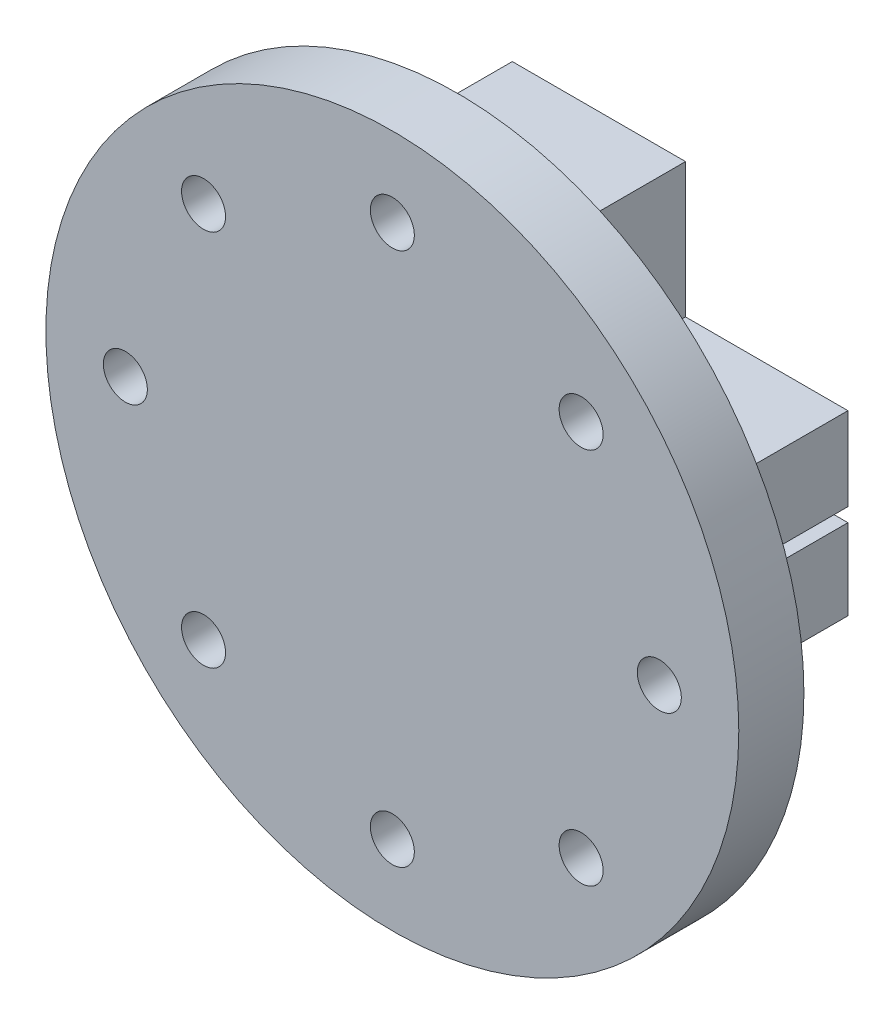
ISO-10303-21;
HEADER;
FILE_DESCRIPTION(('STEP AP214'),'2;1');
FILE_NAME('part.step','',(''),(''),'','','');
FILE_SCHEMA(('AUTOMOTIVE_DESIGN { 1 0 10303 214 1 1 1 1 }'));
ENDSEC;
DATA;
#1=APPLICATION_CONTEXT('core data for automotive mechanical design processes');
#2=APPLICATION_PROTOCOL_DEFINITION('international standard','automotive_design',2000,#1);
#3=PRODUCT_CONTEXT('',#1,'mechanical');
#4=PRODUCT('Part','Part','',(#3));
#5=PRODUCT_RELATED_PRODUCT_CATEGORY('part','',(#4));
#6=PRODUCT_DEFINITION_FORMATION('','',#4);
#7=PRODUCT_DEFINITION_CONTEXT('part definition',#1,'design');
#8=PRODUCT_DEFINITION('design','',#6,#7);
#9=PRODUCT_DEFINITION_SHAPE('','',#8);
#10=(LENGTH_UNIT() NAMED_UNIT(*) SI_UNIT(.MILLI.,.METRE.));
#11=(NAMED_UNIT(*) PLANE_ANGLE_UNIT() SI_UNIT($,.RADIAN.));
#12=(NAMED_UNIT(*) SI_UNIT($,.STERADIAN.) SOLID_ANGLE_UNIT());
#13=UNCERTAINTY_MEASURE_WITH_UNIT(LENGTH_MEASURE(1.E-05),#10,'distance_accuracy_value','');
#14=(GEOMETRIC_REPRESENTATION_CONTEXT(3) GLOBAL_UNCERTAINTY_ASSIGNED_CONTEXT((#13)) GLOBAL_UNIT_ASSIGNED_CONTEXT((#10,
#11,#12)) REPRESENTATION_CONTEXT('',''));
#15=CARTESIAN_POINT('',(0.,0.,0.));
#16=DIRECTION('',(0.,0.,1.));
#17=DIRECTION('',(1.,0.,0.));
#18=AXIS2_PLACEMENT_3D('',#15,#16,#17);
#19=CARTESIAN_POINT('',(0.,0.,0.));
#20=DIRECTION('',(0.,0.,1.));
#21=DIRECTION('',(1.,0.,0.));
#22=AXIS2_PLACEMENT_3D('',#19,#20,#21);
#23=PLANE('',#22);
#24=DIRECTION('',(1.,0.,0.));
#25=VECTOR('',#24,1.);
#26=CARTESIAN_POINT('',(0.,1.,0.));
#27=LINE('',#26,#25);
#28=CARTESIAN_POINT('',(7.7,1.,0.));
#29=VERTEX_POINT('',#28);
#30=CARTESIAN_POINT('',(30.8501032783887,1.,0.));
#31=VERTEX_POINT('',#30);
#32=EDGE_CURVE('E323',#29,#31,#27,.T.);
#33=ORIENTED_EDGE('',*,*,#32,.F.);
#34=DIRECTION('',(0.,-1.,0.));
#35=VECTOR('',#34,1.);
#36=CARTESIAN_POINT('',(7.7,0.,0.));
#37=LINE('',#36,#35);
#38=CARTESIAN_POINT('',(7.7,2.,0.));
#39=VERTEX_POINT('',#38);
#40=EDGE_CURVE('E181',#39,#29,#37,.T.);
#41=ORIENTED_EDGE('',*,*,#40,.F.);
#42=DIRECTION('',(1.,0.,0.));
#43=VECTOR('',#42,1.);
#44=CARTESIAN_POINT('',(0.,2.,0.));
#45=LINE('',#44,#43);
#46=CARTESIAN_POINT('',(5.65685424949238,2.,0.));
#47=VERTEX_POINT('',#46);
#48=EDGE_CURVE('E165',#47,#39,#45,.T.);
#49=ORIENTED_EDGE('',*,*,#48,.F.);
#50=CARTESIAN_POINT('',(0.,0.,0.));
#51=DIRECTION('',(0.,0.,1.));
#52=DIRECTION('',(1.,0.,0.));
#53=AXIS2_PLACEMENT_3D('',#50,#51,#52);
#54=CIRCLE('',#53,6.);
#55=CARTESIAN_POINT('',(5.65685424949238,-2.,0.));
#56=VERTEX_POINT('',#55);
#57=EDGE_CURVE('E348',#47,#56,#54,.T.);
#58=ORIENTED_EDGE('',*,*,#57,.T.);
#59=DIRECTION('',(1.,0.,0.));
#60=VECTOR('',#59,1.);
#61=CARTESIAN_POINT('',(0.,-1.99999999999999,0.));
#62=LINE('',#61,#60);
#63=CARTESIAN_POINT('',(7.7,-2.,0.));
#64=VERTEX_POINT('',#63);
#65=EDGE_CURVE('E341',#56,#64,#62,.T.);
#66=ORIENTED_EDGE('',*,*,#65,.T.);
#67=DIRECTION('',(0.,1.,0.));
#68=VECTOR('',#67,1.);
#69=CARTESIAN_POINT('',(7.7,0.,0.));
#70=LINE('',#69,#68);
#71=CARTESIAN_POINT('',(7.7,-1.,0.));
#72=VERTEX_POINT('',#71);
#73=EDGE_CURVE('E193',#64,#72,#70,.T.);
#74=ORIENTED_EDGE('',*,*,#73,.T.);
#75=DIRECTION('',(1.,0.,0.));
#76=VECTOR('',#75,1.);
#77=CARTESIAN_POINT('',(0.,-1.,0.));
#78=LINE('',#77,#76);
#79=CARTESIAN_POINT('',(30.8501032783887,-1.,0.));
#80=VERTEX_POINT('',#79);
#81=EDGE_CURVE('E331',#72,#80,#78,.T.);
#82=ORIENTED_EDGE('',*,*,#81,.T.);
#83=DIRECTION('',(0.,1.,0.));
#84=VECTOR('',#83,1.);
#85=CARTESIAN_POINT('',(30.8501032783887,0.,0.));
#86=LINE('',#85,#84);
#87=CARTESIAN_POINT('',(30.8501032783887,-12.6414920062023,0.));
#88=VERTEX_POINT('',#87);
#89=EDGE_CURVE('E246',#88,#80,#86,.T.);
#90=ORIENTED_EDGE('',*,*,#89,.F.);
#91=DIRECTION('',(1.,0.,0.));
#92=VECTOR('',#91,1.);
#93=CARTESIAN_POINT('',(30.8501032783887,-12.6414920062023,0.));
#94=LINE('',#93,#92);
#95=CARTESIAN_POINT('',(7.41421356237296,-12.6414920062023,0.));
#96=VERTEX_POINT('',#95);
#97=EDGE_CURVE('E205',#96,#88,#94,.T.);
#98=ORIENTED_EDGE('',*,*,#97,.F.);
#99=DIRECTION('',(0.,-1.,0.));
#100=VECTOR('',#99,1.);
#101=CARTESIAN_POINT('',(7.41421356237295,0.,0.));
#102=LINE('',#101,#100);
#103=CARTESIAN_POINT('',(7.41421356237295,-32.414213562373,0.));
#104=VERTEX_POINT('',#103);
#105=EDGE_CURVE('E250',#96,#104,#102,.T.);
#106=ORIENTED_EDGE('',*,*,#105,.T.);
#107=DIRECTION('',(-1.,0.,0.));
#108=VECTOR('',#107,1.);
#109=CARTESIAN_POINT('',(0.,-32.414213562373,0.));
#110=LINE('',#109,#108);
#111=CARTESIAN_POINT('',(-17.5857864376271,-32.414213562373,0.));
#112=VERTEX_POINT('',#111);
#113=EDGE_CURVE('E254',#104,#112,#110,.T.);
#114=ORIENTED_EDGE('',*,*,#113,.T.);
#115=DIRECTION('',(0.,1.,0.));
#116=VECTOR('',#115,1.);
#117=CARTESIAN_POINT('',(-17.585786437627,0.,0.));
#118=LINE('',#117,#116);
#119=CARTESIAN_POINT('',(-17.585786437627,32.414213562373,0.));
#120=VERTEX_POINT('',#119);
#121=EDGE_CURVE('E258',#112,#120,#118,.T.);
#122=ORIENTED_EDGE('',*,*,#121,.T.);
#123=DIRECTION('',(-1.,0.,0.));
#124=VECTOR('',#123,1.);
#125=CARTESIAN_POINT('',(0.,32.414213562373,0.));
#126=LINE('',#125,#124);
#127=CARTESIAN_POINT('',(7.41421356237296,32.414213562373,0.));
#128=VERTEX_POINT('',#127);
#129=EDGE_CURVE('E262',#128,#120,#126,.T.);
#130=ORIENTED_EDGE('',*,*,#129,.F.);
#131=DIRECTION('',(0.,1.,0.));
#132=VECTOR('',#131,1.);
#133=CARTESIAN_POINT('',(7.41421356237296,0.,0.));
#134=LINE('',#133,#132);
#135=CARTESIAN_POINT('',(7.41421356237295,13.,0.));
#136=VERTEX_POINT('',#135);
#137=EDGE_CURVE('E266',#136,#128,#134,.T.);
#138=ORIENTED_EDGE('',*,*,#137,.F.);
#139=DIRECTION('',(-1.,0.,0.));
#140=VECTOR('',#139,1.);
#141=CARTESIAN_POINT('',(30.8501032783887,13.,0.));
#142=LINE('',#141,#140);
#143=CARTESIAN_POINT('',(30.8501032783887,13.,0.));
#144=VERTEX_POINT('',#143);
#145=EDGE_CURVE('E174',#144,#136,#142,.T.);
#146=ORIENTED_EDGE('',*,*,#145,.F.);
#147=DIRECTION('',(0.,-1.,0.));
#148=VECTOR('',#147,1.);
#149=CARTESIAN_POINT('',(30.8501032783887,0.,0.));
#150=LINE('',#149,#148);
#151=EDGE_CURVE('E270',#144,#31,#150,.T.);
#152=ORIENTED_EDGE('',*,*,#151,.T.);
#153=EDGE_LOOP('',(#33,#41,#49,#58,#66,#74,#82,#90,#98,#106,#114,#122,#130,#138,#146,#152));
#154=FACE_BOUND('',#153,.T.);
#155=ADVANCED_FACE('F42',(#154),#23,.F.);
#156=CARTESIAN_POINT('',(0.,-1.,285.));
#157=DIRECTION('',(0.,1.,0.));
#158=DIRECTION('',(0.,0.,1.));
#159=AXIS2_PLACEMENT_3D('',#156,#157,#158);
#160=PLANE('',#159);
#161=CARTESIAN_POINT('',(19.1321584203808,-1.,12.75));
#162=DIRECTION('',(0.,1.,0.));
#163=DIRECTION('',(0.,0.,1.));
#164=AXIS2_PLACEMENT_3D('',#161,#162,#163);
#165=CIRCLE('',#164,3.175);
#166=CARTESIAN_POINT('',(19.1321584203808,-1.,15.925));
#167=VERTEX_POINT('',#166);
#168=EDGE_CURVE('E230',#167,#167,#165,.T.);
#169=ORIENTED_EDGE('',*,*,#168,.F.);
#170=EDGE_LOOP('',(#169));
#171=FACE_BOUND('',#170,.T.);
#172=ORIENTED_EDGE('',*,*,#81,.F.);
#173=DIRECTION('',(0.,0.,-1.));
#174=VECTOR('',#173,1.);
#175=CARTESIAN_POINT('',(7.7,-1.,25.5));
#176=LINE('',#175,#174);
#177=CARTESIAN_POINT('',(7.7,-1.,25.5));
#178=VERTEX_POINT('',#177);
#179=EDGE_CURVE('E192',#178,#72,#176,.T.);
#180=ORIENTED_EDGE('',*,*,#179,.F.);
#181=DIRECTION('',(-1.,0.,0.));
#182=VECTOR('',#181,1.);
#183=CARTESIAN_POINT('',(0.,-1.,25.5));
#184=LINE('',#183,#182);
#185=CARTESIAN_POINT('',(30.8501032783887,-1.,25.5));
#186=VERTEX_POINT('',#185);
#187=EDGE_CURVE('E334',#186,#178,#184,.T.);
#188=ORIENTED_EDGE('',*,*,#187,.F.);
#189=DIRECTION('',(0.,0.,-1.));
#190=VECTOR('',#189,1.);
#191=CARTESIAN_POINT('',(30.8501032783887,-1.,26.));
#192=LINE('',#191,#190);
#193=EDGE_CURVE('E238',#186,#80,#192,.T.);
#194=ORIENTED_EDGE('',*,*,#193,.T.);
#195=EDGE_LOOP('',(#172,#180,#188,#194));
#196=FACE_BOUND('',#195,.T.);
#197=ADVANCED_FACE('F436',(#171,#196),#160,.T.);
#198=CARTESIAN_POINT('',(0.,0.,25.5));
#199=DIRECTION('',(0.,0.,1.));
#200=DIRECTION('',(1.,0.,0.));
#201=AXIS2_PLACEMENT_3D('',#198,#199,#200);
#202=PLANE('',#201);
#203=DIRECTION('',(-1.,0.,0.));
#204=VECTOR('',#203,1.);
#205=CARTESIAN_POINT('',(0.,2.,25.5));
#206=LINE('',#205,#204);
#207=CARTESIAN_POINT('',(7.7,2.,25.5));
#208=VERTEX_POINT('',#207);
#209=CARTESIAN_POINT('',(5.65685424949238,2.,25.5));
#210=VERTEX_POINT('',#209);
#211=EDGE_CURVE('E155',#208,#210,#206,.T.);
#212=ORIENTED_EDGE('',*,*,#211,.F.);
#213=DIRECTION('',(0.,-1.,0.));
#214=VECTOR('',#213,1.);
#215=CARTESIAN_POINT('',(7.7,0.,25.5));
#216=LINE('',#215,#214);
#217=CARTESIAN_POINT('',(7.7,1.,25.5));
#218=VERTEX_POINT('',#217);
#219=EDGE_CURVE('E59',#208,#218,#216,.T.);
#220=ORIENTED_EDGE('',*,*,#219,.T.);
#221=DIRECTION('',(-1.,0.,0.));
#222=VECTOR('',#221,1.);
#223=CARTESIAN_POINT('',(0.,1.,25.5));
#224=LINE('',#223,#222);
#225=CARTESIAN_POINT('',(30.8501032783887,1.,25.5));
#226=VERTEX_POINT('',#225);
#227=EDGE_CURVE('E338',#226,#218,#224,.T.);
#228=ORIENTED_EDGE('',*,*,#227,.F.);
#229=DIRECTION('',(0.,1.,0.));
#230=VECTOR('',#229,1.);
#231=CARTESIAN_POINT('',(30.8501032783887,0.,25.5));
#232=LINE('',#231,#230);
#233=CARTESIAN_POINT('',(30.8501032783887,13.,25.5));
#234=VERTEX_POINT('',#233);
#235=EDGE_CURVE('E11',#226,#234,#232,.T.);
#236=ORIENTED_EDGE('',*,*,#235,.T.);
#237=DIRECTION('',(-1.,0.,0.));
#238=VECTOR('',#237,1.);
#239=CARTESIAN_POINT('',(30.8501032783887,13.,25.5));
#240=LINE('',#239,#238);
#241=CARTESIAN_POINT('',(7.41421356237295,13.,25.5));
#242=VERTEX_POINT('',#241);
#243=EDGE_CURVE('E217',#234,#242,#240,.T.);
#244=ORIENTED_EDGE('',*,*,#243,.T.);
#245=DIRECTION('',(0.,-1.,0.));
#246=VECTOR('',#245,1.);
#247=CARTESIAN_POINT('',(7.41421356237296,0.,25.5));
#248=LINE('',#247,#246);
#249=CARTESIAN_POINT('',(7.41421356237296,32.414213562373,25.5));
#250=VERTEX_POINT('',#249);
#251=EDGE_CURVE('E51',#250,#242,#248,.T.);
#252=ORIENTED_EDGE('',*,*,#251,.F.);
#253=DIRECTION('',(1.,0.,0.));
#254=VECTOR('',#253,1.);
#255=CARTESIAN_POINT('',(0.,32.414213562373,25.5));
#256=LINE('',#255,#254);
#257=CARTESIAN_POINT('',(-17.585786437627,32.414213562373,25.5));
#258=VERTEX_POINT('',#257);
#259=EDGE_CURVE('E404',#258,#250,#256,.T.);
#260=ORIENTED_EDGE('',*,*,#259,.F.);
#261=DIRECTION('',(0.,-1.,0.));
#262=VECTOR('',#261,1.);
#263=CARTESIAN_POINT('',(-17.585786437627,0.,25.5));
#264=LINE('',#263,#262);
#265=CARTESIAN_POINT('',(-17.5857864376271,-32.414213562373,25.5));
#266=VERTEX_POINT('',#265);
#267=EDGE_CURVE('E401',#258,#266,#264,.T.);
#268=ORIENTED_EDGE('',*,*,#267,.T.);
#269=DIRECTION('',(1.,0.,0.));
#270=VECTOR('',#269,1.);
#271=CARTESIAN_POINT('',(0.,-32.414213562373,25.5));
#272=LINE('',#271,#270);
#273=CARTESIAN_POINT('',(7.41421356237295,-32.414213562373,25.5));
#274=VERTEX_POINT('',#273);
#275=EDGE_CURVE('E398',#266,#274,#272,.T.);
#276=ORIENTED_EDGE('',*,*,#275,.T.);
#277=DIRECTION('',(0.,1.,0.));
#278=VECTOR('',#277,1.);
#279=CARTESIAN_POINT('',(7.41421356237295,0.,25.5));
#280=LINE('',#279,#278);
#281=CARTESIAN_POINT('',(7.41421356237296,-12.6414920062023,25.5));
#282=VERTEX_POINT('',#281);
#283=EDGE_CURVE('E395',#274,#282,#280,.T.);
#284=ORIENTED_EDGE('',*,*,#283,.T.);
#285=DIRECTION('',(1.,0.,0.));
#286=VECTOR('',#285,1.);
#287=CARTESIAN_POINT('',(30.8501032783887,-12.6414920062023,25.5));
#288=LINE('',#287,#286);
#289=CARTESIAN_POINT('',(30.8501032783887,-12.6414920062023,25.5));
#290=VERTEX_POINT('',#289);
#291=EDGE_CURVE('E66',#282,#290,#288,.T.);
#292=ORIENTED_EDGE('',*,*,#291,.T.);
#293=DIRECTION('',(0.,-1.,0.));
#294=VECTOR('',#293,1.);
#295=CARTESIAN_POINT('',(30.8501032783887,0.,25.5));
#296=LINE('',#295,#294);
#297=EDGE_CURVE('E361',#186,#290,#296,.T.);
#298=ORIENTED_EDGE('',*,*,#297,.F.);
#299=ORIENTED_EDGE('',*,*,#187,.T.);
#300=DIRECTION('',(0.,1.,0.));
#301=VECTOR('',#300,1.);
#302=CARTESIAN_POINT('',(7.7,0.,25.5));
#303=LINE('',#302,#301);
#304=CARTESIAN_POINT('',(7.7,-2.,25.5));
#305=VERTEX_POINT('',#304);
#306=EDGE_CURVE('E189',#305,#178,#303,.T.);
#307=ORIENTED_EDGE('',*,*,#306,.F.);
#308=DIRECTION('',(-1.,0.,0.));
#309=VECTOR('',#308,1.);
#310=CARTESIAN_POINT('',(0.,-1.99999999999999,25.5));
#311=LINE('',#310,#309);
#312=CARTESIAN_POINT('',(5.65685424949238,-2.,25.5));
#313=VERTEX_POINT('',#312);
#314=EDGE_CURVE('E164',#305,#313,#311,.T.);
#315=ORIENTED_EDGE('',*,*,#314,.T.);
#316=CARTESIAN_POINT('',(0.,0.,25.5));
#317=DIRECTION('',(0.,0.,1.));
#318=DIRECTION('',(1.,0.,0.));
#319=AXIS2_PLACEMENT_3D('',#316,#317,#318);
#320=CIRCLE('',#319,6.);
#321=EDGE_CURVE('E160',#313,#210,#320,.F.);
#322=ORIENTED_EDGE('',*,*,#321,.T.);
#323=EDGE_LOOP('',(#212,#220,#228,#236,#244,#252,#260,#268,#276,#284,#292,#298,#299,#307,#315,#322));
#324=FACE_BOUND('',#323,.T.);
#325=CARTESIAN_POINT('',(-27.2450640302678,27.2450640302639,25.5));
#326=DIRECTION('',(0.,0.,1.));
#327=DIRECTION('',(1.,0.,0.));
#328=AXIS2_PLACEMENT_3D('',#325,#326,#327);
#329=CIRCLE('',#328,3.17500000000014);
#330=CARTESIAN_POINT('',(-24.0700640302677,27.2450640302639,25.5));
#331=VERTEX_POINT('',#330);
#332=EDGE_CURVE('E299',#331,#331,#329,.T.);
#333=ORIENTED_EDGE('',*,*,#332,.T.);
#334=EDGE_LOOP('',(#333));
#335=FACE_BOUND('',#334,.T.);
#336=CARTESIAN_POINT('',(-38.5303390593265,-3.21174324068629E-12,25.5));
#337=DIRECTION('',(0.,0.,1.));
#338=DIRECTION('',(1.,0.,0.));
#339=AXIS2_PLACEMENT_3D('',#336,#337,#338);
#340=CIRCLE('',#339,3.17499999999894);
#341=CARTESIAN_POINT('',(-35.3553390593275,-3.21174324068629E-12,25.5));
#342=VERTEX_POINT('',#341);
#343=EDGE_CURVE('E304',#342,#342,#340,.T.);
#344=ORIENTED_EDGE('',*,*,#343,.T.);
#345=EDGE_LOOP('',(#344));
#346=FACE_BOUND('',#345,.T.);
#347=CARTESIAN_POINT('',(-27.2450640302655,-27.2450640302694,25.5));
#348=DIRECTION('',(0.,0.,1.));
#349=DIRECTION('',(1.,0.,0.));
#350=AXIS2_PLACEMENT_3D('',#347,#348,#349);
#351=CIRCLE('',#350,3.17499999999801);
#352=CARTESIAN_POINT('',(-24.0700640302675,-27.2450640302694,25.5));
#353=VERTEX_POINT('',#352);
#354=EDGE_CURVE('E308',#353,#353,#351,.T.);
#355=ORIENTED_EDGE('',*,*,#354,.T.);
#356=EDGE_LOOP('',(#355));
#357=FACE_BOUND('',#356,.T.);
#358=CARTESIAN_POINT('',(1.60606603302251E-12,-38.5303390593281,25.5));
#359=DIRECTION('',(0.,0.,1.));
#360=DIRECTION('',(1.,0.,0.));
#361=AXIS2_PLACEMENT_3D('',#358,#359,#360);
#362=CIRCLE('',#361,3.17499999999792);
#363=CARTESIAN_POINT('',(3.17499999999953,-38.5303390593281,25.5));
#364=VERTEX_POINT('',#363);
#365=EDGE_CURVE('E291',#364,#364,#362,.T.);
#366=ORIENTED_EDGE('',*,*,#365,.T.);
#367=EDGE_LOOP('',(#366));
#368=FACE_BOUND('',#367,.T.);
#369=CARTESIAN_POINT('',(27.2450640302678,-27.2450640302671,25.5));
#370=DIRECTION('',(0.,0.,1.));
#371=DIRECTION('',(1.,0.,0.));
#372=AXIS2_PLACEMENT_3D('',#369,#370,#371);
#373=CIRCLE('',#372,3.17499999999871);
#374=CARTESIAN_POINT('',(30.4200640302665,-27.2450640302671,25.5));
#375=VERTEX_POINT('',#374);
#376=EDGE_CURVE('E287',#375,#375,#373,.T.);
#377=ORIENTED_EDGE('',*,*,#376,.T.);
#378=EDGE_LOOP('',(#377));
#379=FACE_BOUND('',#378,.T.);
#380=CARTESIAN_POINT('',(38.5303390593264,0.,25.5));
#381=DIRECTION('',(0.,0.,1.));
#382=DIRECTION('',(1.,0.,0.));
#383=AXIS2_PLACEMENT_3D('',#380,#381,#382);
#384=CIRCLE('',#383,3.17500000000001);
#385=CARTESIAN_POINT('',(41.7053390593264,0.,25.5));
#386=VERTEX_POINT('',#385);
#387=EDGE_CURVE('E292',#386,#386,#384,.T.);
#388=ORIENTED_EDGE('',*,*,#387,.T.);
#389=EDGE_LOOP('',(#388));
#390=FACE_BOUND('',#389,.T.);
#391=CARTESIAN_POINT('',(-1.61078463866241E-12,38.5303390593249,25.5));
#392=DIRECTION('',(0.,0.,1.));
#393=DIRECTION('',(1.,0.,0.));
#394=AXIS2_PLACEMENT_3D('',#391,#392,#393);
#395=CIRCLE('',#394,3.1750000000009);
#396=CARTESIAN_POINT('',(3.17499999999929,38.5303390593249,25.5));
#397=VERTEX_POINT('',#396);
#398=EDGE_CURVE('E278',#397,#397,#395,.T.);
#399=ORIENTED_EDGE('',*,*,#398,.T.);
#400=EDGE_LOOP('',(#399));
#401=FACE_BOUND('',#400,.T.);
#402=CARTESIAN_POINT('',(27.2450640302655,27.2450640302662,25.5));
#403=DIRECTION('',(0.,0.,1.));
#404=DIRECTION('',(1.,0.,0.));
#405=AXIS2_PLACEMENT_3D('',#402,#403,#404);
#406=CIRCLE('',#405,3.17500000000076);
#407=CARTESIAN_POINT('',(30.4200640302663,27.2450640302662,25.5));
#408=VERTEX_POINT('',#407);
#409=EDGE_CURVE('E303',#408,#408,#406,.T.);
#410=ORIENTED_EDGE('',*,*,#409,.T.);
#411=EDGE_LOOP('',(#410));
#412=FACE_BOUND('',#411,.T.);
#413=CARTESIAN_POINT('',(0.,0.,25.5));
#414=DIRECTION('',(0.,0.,1.));
#415=DIRECTION('',(1.,0.,0.));
#416=AXIS2_PLACEMENT_3D('',#413,#414,#415);
#417=CIRCLE('',#416,50.);
#418=CARTESIAN_POINT('',(50.,0.,25.5));
#419=VERTEX_POINT('',#418);
#420=EDGE_CURVE('E324',#419,#419,#417,.T.);
#421=ORIENTED_EDGE('',*,*,#420,.F.);
#422=EDGE_LOOP('',(#421));
#423=FACE_BOUND('',#422,.T.);
#424=ADVANCED_FACE('F157',(#324,#335,#346,#357,#368,#379,#390,#401,#412,#423),#202,.F.);
#425=CARTESIAN_POINT('',(0.,0.,46.));
#426=DIRECTION('',(0.,0.,-1.));
#427=DIRECTION('',(-1.,0.,0.));
#428=AXIS2_PLACEMENT_3D('',#425,#426,#427);
#429=CYLINDRICAL_SURFACE('',#428,6.);
#430=ORIENTED_EDGE('',*,*,#321,.F.);
#431=DIRECTION('',(0.,0.,-1.));
#432=VECTOR('',#431,1.);
#433=CARTESIAN_POINT('',(5.65685424949238,-2.,46.));
#434=LINE('',#433,#432);
#435=EDGE_CURVE('E357',#313,#56,#434,.T.);
#436=ORIENTED_EDGE('',*,*,#435,.T.);
#437=ORIENTED_EDGE('',*,*,#57,.F.);
#438=DIRECTION('',(0.,0.,-1.));
#439=VECTOR('',#438,1.);
#440=CARTESIAN_POINT('',(5.65685424949238,2.,46.));
#441=LINE('',#440,#439);
#442=EDGE_CURVE('E354',#210,#47,#441,.T.);
#443=ORIENTED_EDGE('',*,*,#442,.F.);
#444=EDGE_LOOP('',(#430,#436,#437,#443));
#445=FACE_BOUND('',#444,.T.);
#446=ADVANCED_FACE('F492',(#445),#429,.F.);
#447=CARTESIAN_POINT('',(0.,-1.99999999999999,97.0000000000001));
#448=DIRECTION('',(0.,1.,0.));
#449=DIRECTION('',(-1.,0.,0.));
#450=AXIS2_PLACEMENT_3D('',#447,#448,#449);
#451=PLANE('',#450);
#452=ORIENTED_EDGE('',*,*,#314,.F.);
#453=DIRECTION('',(0.,0.,-1.));
#454=VECTOR('',#453,1.);
#455=CARTESIAN_POINT('',(7.7,-2.,25.5));
#456=LINE('',#455,#454);
#457=EDGE_CURVE('E186',#305,#64,#456,.T.);
#458=ORIENTED_EDGE('',*,*,#457,.T.);
#459=ORIENTED_EDGE('',*,*,#65,.F.);
#460=ORIENTED_EDGE('',*,*,#435,.F.);
#461=EDGE_LOOP('',(#452,#458,#459,#460));
#462=FACE_BOUND('',#461,.T.);
#463=ADVANCED_FACE('F490',(#462),#451,.T.);
#464=CARTESIAN_POINT('',(0.,2.,97.0000000000001));
#465=DIRECTION('',(0.,1.,0.));
#466=DIRECTION('',(-1.,0.,0.));
#467=AXIS2_PLACEMENT_3D('',#464,#465,#466);
#468=PLANE('',#467);
#469=ORIENTED_EDGE('',*,*,#211,.T.);
#470=ORIENTED_EDGE('',*,*,#442,.T.);
#471=ORIENTED_EDGE('',*,*,#48,.T.);
#472=DIRECTION('',(0.,0.,-1.));
#473=VECTOR('',#472,1.);
#474=CARTESIAN_POINT('',(7.7,2.,25.5));
#475=LINE('',#474,#473);
#476=EDGE_CURVE('E168',#208,#39,#475,.T.);
#477=ORIENTED_EDGE('',*,*,#476,.F.);
#478=EDGE_LOOP('',(#469,#470,#471,#477));
#479=FACE_BOUND('',#478,.T.);
#480=ADVANCED_FACE('F169',(#479),#468,.F.);
#481=CARTESIAN_POINT('',(0.,1.,285.));
#482=DIRECTION('',(0.,1.,0.));
#483=DIRECTION('',(0.,0.,1.));
#484=AXIS2_PLACEMENT_3D('',#481,#482,#483);
#485=PLANE('',#484);
#486=CARTESIAN_POINT('',(19.1321584203808,1.,12.75));
#487=DIRECTION('',(0.,1.,0.));
#488=DIRECTION('',(0.,0.,1.));
#489=AXIS2_PLACEMENT_3D('',#486,#487,#488);
#490=CIRCLE('',#489,3.175);
#491=CARTESIAN_POINT('',(19.1321584203808,1.,15.925));
#492=VERTEX_POINT('',#491);
#493=EDGE_CURVE('E234',#492,#492,#490,.T.);
#494=ORIENTED_EDGE('',*,*,#493,.T.);
#495=EDGE_LOOP('',(#494));
#496=FACE_BOUND('',#495,.T.);
#497=ORIENTED_EDGE('',*,*,#227,.T.);
#498=DIRECTION('',(0.,0.,-1.));
#499=VECTOR('',#498,1.);
#500=CARTESIAN_POINT('',(7.7,1.,25.5));
#501=LINE('',#500,#499);
#502=EDGE_CURVE('E175',#218,#29,#501,.T.);
#503=ORIENTED_EDGE('',*,*,#502,.T.);
#504=ORIENTED_EDGE('',*,*,#32,.T.);
#505=DIRECTION('',(0.,0.,-1.));
#506=VECTOR('',#505,1.);
#507=CARTESIAN_POINT('',(30.8501032783887,1.,26.));
#508=LINE('',#507,#506);
#509=EDGE_CURVE('E242',#226,#31,#508,.T.);
#510=ORIENTED_EDGE('',*,*,#509,.F.);
#511=EDGE_LOOP('',(#497,#503,#504,#510));
#512=FACE_BOUND('',#511,.T.);
#513=ADVANCED_FACE('F448',(#496,#512),#485,.F.);
#514=CARTESIAN_POINT('',(0.,0.,34.898));
#515=DIRECTION('',(0.,0.,-1.));
#516=DIRECTION('',(-1.,0.,0.));
#517=AXIS2_PLACEMENT_3D('',#514,#515,#516);
#518=CYLINDRICAL_SURFACE('',#517,50.);
#519=CARTESIAN_POINT('',(0.,0.,34.898));
#520=DIRECTION('',(0.,0.,1.));
#521=DIRECTION('',(1.,0.,0.));
#522=AXIS2_PLACEMENT_3D('',#519,#520,#521);
#523=CIRCLE('',#522,50.);
#524=CARTESIAN_POINT('',(50.,0.,34.898));
#525=VERTEX_POINT('',#524);
#526=EDGE_CURVE('E319',#525,#525,#523,.T.);
#527=ORIENTED_EDGE('',*,*,#526,.F.);
#528=EDGE_LOOP('',(#527));
#529=FACE_BOUND('',#528,.T.);
#530=ORIENTED_EDGE('',*,*,#420,.T.);
#531=EDGE_LOOP('',(#530));
#532=FACE_BOUND('',#531,.T.);
#533=ADVANCED_FACE('F504',(#529,#532),#518,.T.);
#534=CARTESIAN_POINT('',(0.,0.,34.898));
#535=DIRECTION('',(0.,0.,1.));
#536=DIRECTION('',(1.,0.,0.));
#537=AXIS2_PLACEMENT_3D('',#534,#535,#536);
#538=PLANE('',#537);
#539=CARTESIAN_POINT('',(-27.2450640302678,27.2450640302639,34.898));
#540=DIRECTION('',(0.,0.,1.));
#541=DIRECTION('',(1.,0.,0.));
#542=AXIS2_PLACEMENT_3D('',#539,#540,#541);
#543=CIRCLE('',#542,3.17500000000014);
#544=CARTESIAN_POINT('',(-24.0700640302677,27.2450640302639,34.898));
#545=VERTEX_POINT('',#544);
#546=EDGE_CURVE('E328',#545,#545,#543,.F.);
#547=ORIENTED_EDGE('',*,*,#546,.T.);
#548=EDGE_LOOP('',(#547));
#549=FACE_BOUND('',#548,.T.);
#550=CARTESIAN_POINT('',(-38.5303390593265,-3.21174324068629E-12,34.898));
#551=DIRECTION('',(0.,0.,1.));
#552=DIRECTION('',(1.,0.,0.));
#553=AXIS2_PLACEMENT_3D('',#550,#551,#552);
#554=CIRCLE('',#553,3.17499999999894);
#555=CARTESIAN_POINT('',(-35.3553390593275,-3.21174324068629E-12,34.898));
#556=VERTEX_POINT('',#555);
#557=EDGE_CURVE('E385',#556,#556,#554,.F.);
#558=ORIENTED_EDGE('',*,*,#557,.T.);
#559=EDGE_LOOP('',(#558));
#560=FACE_BOUND('',#559,.T.);
#561=CARTESIAN_POINT('',(-27.2450640302655,-27.2450640302694,34.898));
#562=DIRECTION('',(0.,0.,1.));
#563=DIRECTION('',(1.,0.,0.));
#564=AXIS2_PLACEMENT_3D('',#561,#562,#563);
#565=CIRCLE('',#564,3.17499999999801);
#566=CARTESIAN_POINT('',(-24.0700640302675,-27.2450640302694,34.898));
#567=VERTEX_POINT('',#566);
#568=EDGE_CURVE('E381',#567,#567,#565,.F.);
#569=ORIENTED_EDGE('',*,*,#568,.T.);
#570=EDGE_LOOP('',(#569));
#571=FACE_BOUND('',#570,.T.);
#572=CARTESIAN_POINT('',(1.60606603302251E-12,-38.5303390593281,34.898));
#573=DIRECTION('',(0.,0.,1.));
#574=DIRECTION('',(1.,0.,0.));
#575=AXIS2_PLACEMENT_3D('',#572,#573,#574);
#576=CIRCLE('',#575,3.17499999999792);
#577=CARTESIAN_POINT('',(3.17499999999953,-38.5303390593281,34.898));
#578=VERTEX_POINT('',#577);
#579=EDGE_CURVE('E377',#578,#578,#576,.F.);
#580=ORIENTED_EDGE('',*,*,#579,.T.);
#581=EDGE_LOOP('',(#580));
#582=FACE_BOUND('',#581,.T.);
#583=CARTESIAN_POINT('',(27.2450640302678,-27.2450640302671,34.898));
#584=DIRECTION('',(0.,0.,1.));
#585=DIRECTION('',(1.,0.,0.));
#586=AXIS2_PLACEMENT_3D('',#583,#584,#585);
#587=CIRCLE('',#586,3.17499999999871);
#588=CARTESIAN_POINT('',(30.4200640302665,-27.2450640302671,34.898));
#589=VERTEX_POINT('',#588);
#590=EDGE_CURVE('E373',#589,#589,#587,.F.);
#591=ORIENTED_EDGE('',*,*,#590,.T.);
#592=EDGE_LOOP('',(#591));
#593=FACE_BOUND('',#592,.T.);
#594=CARTESIAN_POINT('',(38.5303390593264,0.,34.898));
#595=DIRECTION('',(0.,0.,1.));
#596=DIRECTION('',(1.,0.,0.));
#597=AXIS2_PLACEMENT_3D('',#594,#595,#596);
#598=CIRCLE('',#597,3.17500000000001);
#599=CARTESIAN_POINT('',(41.7053390593264,0.,34.898));
#600=VERTEX_POINT('',#599);
#601=EDGE_CURVE('E369',#600,#600,#598,.F.);
#602=ORIENTED_EDGE('',*,*,#601,.T.);
#603=EDGE_LOOP('',(#602));
#604=FACE_BOUND('',#603,.T.);
#605=CARTESIAN_POINT('',(-1.61078463866241E-12,38.5303390593249,34.898));
#606=DIRECTION('',(0.,0.,1.));
#607=DIRECTION('',(1.,0.,0.));
#608=AXIS2_PLACEMENT_3D('',#605,#606,#607);
#609=CIRCLE('',#608,3.1750000000009);
#610=CARTESIAN_POINT('',(3.17499999999929,38.5303390593249,34.898));
#611=VERTEX_POINT('',#610);
#612=EDGE_CURVE('E365',#611,#611,#609,.F.);
#613=ORIENTED_EDGE('',*,*,#612,.T.);
#614=EDGE_LOOP('',(#613));
#615=FACE_BOUND('',#614,.T.);
#616=CARTESIAN_POINT('',(27.2450640302655,27.2450640302662,34.898));
#617=DIRECTION('',(0.,0.,1.));
#618=DIRECTION('',(1.,0.,0.));
#619=AXIS2_PLACEMENT_3D('',#616,#617,#618);
#620=CIRCLE('',#619,3.17500000000076);
#621=CARTESIAN_POINT('',(30.4200640302663,27.2450640302662,34.898));
#622=VERTEX_POINT('',#621);
#623=EDGE_CURVE('E318',#622,#622,#620,.F.);
#624=ORIENTED_EDGE('',*,*,#623,.T.);
#625=EDGE_LOOP('',(#624));
#626=FACE_BOUND('',#625,.T.);
#627=ORIENTED_EDGE('',*,*,#526,.T.);
#628=EDGE_LOOP('',(#627));
#629=FACE_BOUND('',#628,.T.);
#630=ADVANCED_FACE('F508',(#549,#560,#571,#582,#593,#604,#615,#626,#629),#538,.T.);
#631=CARTESIAN_POINT('',(27.2450640302655,27.2450640302662,88.5));
#632=DIRECTION('',(0.,0.,-1.));
#633=DIRECTION('',(-1.,0.,0.));
#634=AXIS2_PLACEMENT_3D('',#631,#632,#633);
#635=CYLINDRICAL_SURFACE('',#634,3.17500000000076);
#636=ORIENTED_EDGE('',*,*,#623,.F.);
#637=EDGE_LOOP('',(#636));
#638=FACE_BOUND('',#637,.T.);
#639=ORIENTED_EDGE('',*,*,#409,.F.);
#640=EDGE_LOOP('',(#639));
#641=FACE_BOUND('',#640,.T.);
#642=ADVANCED_FACE('F513',(#638,#641),#635,.F.);
#643=CARTESIAN_POINT('',(-1.61078463866241E-12,38.5303390593249,88.5));
#644=DIRECTION('',(0.,0.,-1.));
#645=DIRECTION('',(-1.,0.,0.));
#646=AXIS2_PLACEMENT_3D('',#643,#644,#645);
#647=CYLINDRICAL_SURFACE('',#646,3.1750000000009);
#648=ORIENTED_EDGE('',*,*,#612,.F.);
#649=EDGE_LOOP('',(#648));
#650=FACE_BOUND('',#649,.T.);
#651=ORIENTED_EDGE('',*,*,#398,.F.);
#652=EDGE_LOOP('',(#651));
#653=FACE_BOUND('',#652,.T.);
#654=ADVANCED_FACE('F517',(#650,#653),#647,.F.);
#655=CARTESIAN_POINT('',(38.5303390593264,0.,88.5));
#656=DIRECTION('',(0.,0.,-1.));
#657=DIRECTION('',(-1.,0.,0.));
#658=AXIS2_PLACEMENT_3D('',#655,#656,#657);
#659=CYLINDRICAL_SURFACE('',#658,3.17500000000001);
#660=ORIENTED_EDGE('',*,*,#601,.F.);
#661=EDGE_LOOP('',(#660));
#662=FACE_BOUND('',#661,.T.);
#663=ORIENTED_EDGE('',*,*,#387,.F.);
#664=EDGE_LOOP('',(#663));
#665=FACE_BOUND('',#664,.T.);
#666=ADVANCED_FACE('F538',(#662,#665),#659,.F.);
#667=CARTESIAN_POINT('',(27.2450640302678,-27.2450640302671,88.5));
#668=DIRECTION('',(0.,0.,-1.));
#669=DIRECTION('',(-1.,0.,0.));
#670=AXIS2_PLACEMENT_3D('',#667,#668,#669);
#671=CYLINDRICAL_SURFACE('',#670,3.17499999999871);
#672=ORIENTED_EDGE('',*,*,#590,.F.);
#673=EDGE_LOOP('',(#672));
#674=FACE_BOUND('',#673,.T.);
#675=ORIENTED_EDGE('',*,*,#376,.F.);
#676=EDGE_LOOP('',(#675));
#677=FACE_BOUND('',#676,.T.);
#678=ADVANCED_FACE('F523',(#674,#677),#671,.F.);
#679=CARTESIAN_POINT('',(1.60606603302251E-12,-38.5303390593281,88.5));
#680=DIRECTION('',(0.,0.,-1.));
#681=DIRECTION('',(-1.,0.,0.));
#682=AXIS2_PLACEMENT_3D('',#679,#680,#681);
#683=CYLINDRICAL_SURFACE('',#682,3.17499999999792);
#684=ORIENTED_EDGE('',*,*,#579,.F.);
#685=EDGE_LOOP('',(#684));
#686=FACE_BOUND('',#685,.T.);
#687=ORIENTED_EDGE('',*,*,#365,.F.);
#688=EDGE_LOOP('',(#687));
#689=FACE_BOUND('',#688,.T.);
#690=ADVANCED_FACE('F519',(#686,#689),#683,.F.);
#691=CARTESIAN_POINT('',(-27.2450640302655,-27.2450640302694,88.5));
#692=DIRECTION('',(0.,0.,-1.));
#693=DIRECTION('',(-1.,0.,0.));
#694=AXIS2_PLACEMENT_3D('',#691,#692,#693);
#695=CYLINDRICAL_SURFACE('',#694,3.17499999999801);
#696=ORIENTED_EDGE('',*,*,#568,.F.);
#697=EDGE_LOOP('',(#696));
#698=FACE_BOUND('',#697,.T.);
#699=ORIENTED_EDGE('',*,*,#354,.F.);
#700=EDGE_LOOP('',(#699));
#701=FACE_BOUND('',#700,.T.);
#702=ADVANCED_FACE('F522',(#698,#701),#695,.F.);
#703=CARTESIAN_POINT('',(-38.5303390593265,-3.21174324068629E-12,88.5));
#704=DIRECTION('',(0.,0.,-1.));
#705=DIRECTION('',(-1.,0.,0.));
#706=AXIS2_PLACEMENT_3D('',#703,#704,#705);
#707=CYLINDRICAL_SURFACE('',#706,3.17499999999894);
#708=ORIENTED_EDGE('',*,*,#557,.F.);
#709=EDGE_LOOP('',(#708));
#710=FACE_BOUND('',#709,.T.);
#711=ORIENTED_EDGE('',*,*,#343,.F.);
#712=EDGE_LOOP('',(#711));
#713=FACE_BOUND('',#712,.T.);
#714=ADVANCED_FACE('F527',(#710,#713),#707,.F.);
#715=CARTESIAN_POINT('',(-27.2450640302678,27.2450640302639,88.5));
#716=DIRECTION('',(0.,0.,-1.));
#717=DIRECTION('',(-1.,0.,0.));
#718=AXIS2_PLACEMENT_3D('',#715,#716,#717);
#719=CYLINDRICAL_SURFACE('',#718,3.17500000000014);
#720=ORIENTED_EDGE('',*,*,#546,.F.);
#721=EDGE_LOOP('',(#720));
#722=FACE_BOUND('',#721,.T.);
#723=ORIENTED_EDGE('',*,*,#332,.F.);
#724=EDGE_LOOP('',(#723));
#725=FACE_BOUND('',#724,.T.);
#726=ADVANCED_FACE('F531',(#722,#725),#719,.F.);
#727=CARTESIAN_POINT('',(30.8501032783887,0.,26.));
#728=DIRECTION('',(1.,0.,0.));
#729=DIRECTION('',(0.,1.,0.));
#730=AXIS2_PLACEMENT_3D('',#727,#728,#729);
#731=PLANE('',#730);
#732=DIRECTION('',(0.,0.,-1.));
#733=VECTOR('',#732,1.);
#734=CARTESIAN_POINT('',(30.8501032783887,13.,25.5));
#735=LINE('',#734,#733);
#736=EDGE_CURVE('E221',#234,#144,#735,.T.);
#737=ORIENTED_EDGE('',*,*,#736,.F.);
#738=ORIENTED_EDGE('',*,*,#235,.F.);
#739=ORIENTED_EDGE('',*,*,#509,.T.);
#740=ORIENTED_EDGE('',*,*,#151,.F.);
#741=EDGE_LOOP('',(#737,#738,#739,#740));
#742=FACE_BOUND('',#741,.T.);
#743=ADVANCED_FACE('F452',(#742),#731,.T.);
#744=CARTESIAN_POINT('',(7.41421356237296,0.,26.));
#745=DIRECTION('',(-1.,0.,0.));
#746=DIRECTION('',(0.,0.,1.));
#747=AXIS2_PLACEMENT_3D('',#744,#745,#746);
#748=PLANE('',#747);
#749=DIRECTION('',(0.,0.,-1.));
#750=VECTOR('',#749,1.);
#751=CARTESIAN_POINT('',(7.41421356237296,32.414213562373,26.));
#752=LINE('',#751,#750);
#753=EDGE_CURVE('E275',#250,#128,#752,.T.);
#754=ORIENTED_EDGE('',*,*,#753,.F.);
#755=ORIENTED_EDGE('',*,*,#251,.T.);
#756=DIRECTION('',(0.,0.,-1.));
#757=VECTOR('',#756,1.);
#758=CARTESIAN_POINT('',(7.41421356237295,13.,25.5));
#759=LINE('',#758,#757);
#760=EDGE_CURVE('E208',#242,#136,#759,.T.);
#761=ORIENTED_EDGE('',*,*,#760,.T.);
#762=ORIENTED_EDGE('',*,*,#137,.T.);
#763=EDGE_LOOP('',(#754,#755,#761,#762));
#764=FACE_BOUND('',#763,.T.);
#765=ADVANCED_FACE('F458',(#764),#748,.F.);
#766=CARTESIAN_POINT('',(0.,32.414213562373,26.));
#767=DIRECTION('',(0.,-1.,0.));
#768=DIRECTION('',(0.,0.,-1.));
#769=AXIS2_PLACEMENT_3D('',#766,#767,#768);
#770=PLANE('',#769);
#771=DIRECTION('',(0.,0.,-1.));
#772=VECTOR('',#771,1.);
#773=CARTESIAN_POINT('',(-17.585786437627,32.414213562373,26.));
#774=LINE('',#773,#772);
#775=EDGE_CURVE('E279',#258,#120,#774,.T.);
#776=ORIENTED_EDGE('',*,*,#775,.F.);
#777=ORIENTED_EDGE('',*,*,#259,.T.);
#778=ORIENTED_EDGE('',*,*,#753,.T.);
#779=ORIENTED_EDGE('',*,*,#129,.T.);
#780=EDGE_LOOP('',(#776,#777,#778,#779));
#781=FACE_BOUND('',#780,.T.);
#782=ADVANCED_FACE('F462',(#781),#770,.F.);
#783=CARTESIAN_POINT('',(-17.585786437627,0.,26.));
#784=DIRECTION('',(-1.,0.,0.));
#785=DIRECTION('',(0.,0.,1.));
#786=AXIS2_PLACEMENT_3D('',#783,#784,#785);
#787=PLANE('',#786);
#788=ORIENTED_EDGE('',*,*,#267,.F.);
#789=ORIENTED_EDGE('',*,*,#775,.T.);
#790=ORIENTED_EDGE('',*,*,#121,.F.);
#791=DIRECTION('',(0.,0.,-1.));
#792=VECTOR('',#791,1.);
#793=CARTESIAN_POINT('',(-17.5857864376271,-32.414213562373,26.));
#794=LINE('',#793,#792);
#795=EDGE_CURVE('E282',#266,#112,#794,.T.);
#796=ORIENTED_EDGE('',*,*,#795,.F.);
#797=EDGE_LOOP('',(#788,#789,#790,#796));
#798=FACE_BOUND('',#797,.T.);
#799=ADVANCED_FACE('F465',(#798),#787,.T.);
#800=CARTESIAN_POINT('',(0.,-32.414213562373,26.));
#801=DIRECTION('',(0.,-1.,0.));
#802=DIRECTION('',(0.,0.,-1.));
#803=AXIS2_PLACEMENT_3D('',#800,#801,#802);
#804=PLANE('',#803);
#805=ORIENTED_EDGE('',*,*,#275,.F.);
#806=ORIENTED_EDGE('',*,*,#795,.T.);
#807=ORIENTED_EDGE('',*,*,#113,.F.);
#808=DIRECTION('',(0.,0.,-1.));
#809=VECTOR('',#808,1.);
#810=CARTESIAN_POINT('',(7.41421356237295,-32.414213562373,26.));
#811=LINE('',#810,#809);
#812=EDGE_CURVE('E274',#274,#104,#811,.T.);
#813=ORIENTED_EDGE('',*,*,#812,.F.);
#814=EDGE_LOOP('',(#805,#806,#807,#813));
#815=FACE_BOUND('',#814,.T.);
#816=ADVANCED_FACE('F471',(#815),#804,.T.);
#817=CARTESIAN_POINT('',(7.41421356237295,0.,26.));
#818=DIRECTION('',(1.,0.,0.));
#819=DIRECTION('',(0.,0.,-1.));
#820=AXIS2_PLACEMENT_3D('',#817,#818,#819);
#821=PLANE('',#820);
#822=ORIENTED_EDGE('',*,*,#283,.F.);
#823=ORIENTED_EDGE('',*,*,#812,.T.);
#824=ORIENTED_EDGE('',*,*,#105,.F.);
#825=DIRECTION('',(0.,0.,-1.));
#826=VECTOR('',#825,1.);
#827=CARTESIAN_POINT('',(7.41421356237296,-12.6414920062023,25.5));
#828=LINE('',#827,#826);
#829=EDGE_CURVE('E204',#282,#96,#828,.T.);
#830=ORIENTED_EDGE('',*,*,#829,.F.);
#831=EDGE_LOOP('',(#822,#823,#824,#830));
#832=FACE_BOUND('',#831,.T.);
#833=ADVANCED_FACE('F474',(#832),#821,.T.);
#834=CARTESIAN_POINT('',(30.8501032783887,0.,26.));
#835=DIRECTION('',(-1.,0.,0.));
#836=DIRECTION('',(0.,0.,1.));
#837=AXIS2_PLACEMENT_3D('',#834,#835,#836);
#838=PLANE('',#837);
#839=ORIENTED_EDGE('',*,*,#297,.T.);
#840=DIRECTION('',(0.,0.,-1.));
#841=VECTOR('',#840,1.);
#842=CARTESIAN_POINT('',(30.8501032783887,-12.6414920062023,25.5));
#843=LINE('',#842,#841);
#844=EDGE_CURVE('E209',#290,#88,#843,.T.);
#845=ORIENTED_EDGE('',*,*,#844,.T.);
#846=ORIENTED_EDGE('',*,*,#89,.T.);
#847=ORIENTED_EDGE('',*,*,#193,.F.);
#848=EDGE_LOOP('',(#839,#845,#846,#847));
#849=FACE_BOUND('',#848,.T.);
#850=ADVANCED_FACE('F480',(#849),#838,.F.);
#851=CARTESIAN_POINT('',(19.1321584203808,31.3585079937977,12.75));
#852=DIRECTION('',(0.,-1.,0.));
#853=DIRECTION('',(0.,0.,-1.));
#854=AXIS2_PLACEMENT_3D('',#851,#852,#853);
#855=CYLINDRICAL_SURFACE('',#854,3.175);
#856=CARTESIAN_POINT('',(19.1321584203808,-12.6414920062023,12.75));
#857=DIRECTION('',(0.,1.,0.));
#858=DIRECTION('',(-1.,0.,0.));
#859=AXIS2_PLACEMENT_3D('',#856,#857,#858);
#860=CIRCLE('',#859,3.175);
#861=CARTESIAN_POINT('',(15.9571584203808,-12.6414920062023,12.75));
#862=VERTEX_POINT('',#861);
#863=EDGE_CURVE('E45',#862,#862,#860,.F.);
#864=ORIENTED_EDGE('',*,*,#863,.T.);
#865=EDGE_LOOP('',(#864));
#866=FACE_BOUND('',#865,.T.);
#867=ORIENTED_EDGE('',*,*,#168,.T.);
#868=EDGE_LOOP('',(#867));
#869=FACE_BOUND('',#868,.T.);
#870=ADVANCED_FACE('F417',(#866,#869),#855,.F.);
#871=CARTESIAN_POINT('',(19.1321584203808,13.,12.75));
#872=DIRECTION('',(0.,-1.,0.));
#873=DIRECTION('',(0.,0.,-1.));
#874=AXIS2_PLACEMENT_3D('',#871,#872,#873);
#875=CIRCLE('',#874,3.175);
#876=CARTESIAN_POINT('',(19.1321584203808,13.,9.575));
#877=VERTEX_POINT('',#876);
#878=EDGE_CURVE('E213',#877,#877,#875,.F.);
#879=ORIENTED_EDGE('',*,*,#878,.T.);
#880=EDGE_LOOP('',(#879));
#881=FACE_BOUND('',#880,.T.);
#882=ORIENTED_EDGE('',*,*,#493,.F.);
#883=EDGE_LOOP('',(#882));
#884=FACE_BOUND('',#883,.T.);
#885=ADVANCED_FACE('F432',(#881,#884),#855,.F.);
#886=CARTESIAN_POINT('',(30.8501032783887,13.,25.5));
#887=DIRECTION('',(0.,-1.,0.));
#888=DIRECTION('',(0.,0.,-1.));
#889=AXIS2_PLACEMENT_3D('',#886,#887,#888);
#890=PLANE('',#889);
#891=ORIENTED_EDGE('',*,*,#145,.T.);
#892=ORIENTED_EDGE('',*,*,#760,.F.);
#893=ORIENTED_EDGE('',*,*,#243,.F.);
#894=ORIENTED_EDGE('',*,*,#736,.T.);
#895=EDGE_LOOP('',(#891,#892,#893,#894));
#896=FACE_BOUND('',#895,.T.);
#897=ORIENTED_EDGE('',*,*,#878,.F.);
#898=EDGE_LOOP('',(#897));
#899=FACE_BOUND('',#898,.T.);
#900=ADVANCED_FACE('F423',(#896,#899),#890,.F.);
#901=CARTESIAN_POINT('',(30.8501032783887,-12.6414920062023,25.5));
#902=DIRECTION('',(0.,1.,0.));
#903=DIRECTION('',(-1.,0.,0.));
#904=AXIS2_PLACEMENT_3D('',#901,#902,#903);
#905=PLANE('',#904);
#906=ORIENTED_EDGE('',*,*,#97,.T.);
#907=ORIENTED_EDGE('',*,*,#844,.F.);
#908=ORIENTED_EDGE('',*,*,#291,.F.);
#909=ORIENTED_EDGE('',*,*,#829,.T.);
#910=EDGE_LOOP('',(#906,#907,#908,#909));
#911=FACE_BOUND('',#910,.T.);
#912=ORIENTED_EDGE('',*,*,#863,.F.);
#913=EDGE_LOOP('',(#912));
#914=FACE_BOUND('',#913,.T.);
#915=ADVANCED_FACE('F420',(#911,#914),#905,.F.);
#916=CARTESIAN_POINT('',(7.7,0.,25.5));
#917=DIRECTION('',(-1.,0.,0.));
#918=DIRECTION('',(0.,-1.,0.));
#919=AXIS2_PLACEMENT_3D('',#916,#917,#918);
#920=PLANE('',#919);
#921=ORIENTED_EDGE('',*,*,#73,.F.);
#922=ORIENTED_EDGE('',*,*,#457,.F.);
#923=ORIENTED_EDGE('',*,*,#306,.T.);
#924=ORIENTED_EDGE('',*,*,#179,.T.);
#925=EDGE_LOOP('',(#921,#922,#923,#924));
#926=FACE_BOUND('',#925,.T.);
#927=ADVANCED_FACE('F422',(#926),#920,.T.);
#928=CARTESIAN_POINT('',(7.7,0.,25.5));
#929=DIRECTION('',(1.,0.,0.));
#930=DIRECTION('',(0.,0.,-1.));
#931=AXIS2_PLACEMENT_3D('',#928,#929,#930);
#932=PLANE('',#931);
#933=ORIENTED_EDGE('',*,*,#40,.T.);
#934=ORIENTED_EDGE('',*,*,#502,.F.);
#935=ORIENTED_EDGE('',*,*,#219,.F.);
#936=ORIENTED_EDGE('',*,*,#476,.T.);
#937=EDGE_LOOP('',(#933,#934,#935,#936));
#938=FACE_BOUND('',#937,.T.);
#939=ADVANCED_FACE('F177',(#938),#932,.F.);
#940=CLOSED_SHELL('',(#155,#197,#424,#446,#463,#480,#513,#533,#630,#642,#654,#666,#678,#690,
#702,#714,#726,#743,#765,#782,#799,#816,#833,#850,#870,#885,#900,#915,#927,#939));
#941=MANIFOLD_SOLID_BREP('B2',#940);
#942=ADVANCED_BREP_SHAPE_REPRESENTATION('',(#18,#941),#14);
#943=SHAPE_DEFINITION_REPRESENTATION(#9,#942);
ENDSEC;
END-ISO-10303-21;
